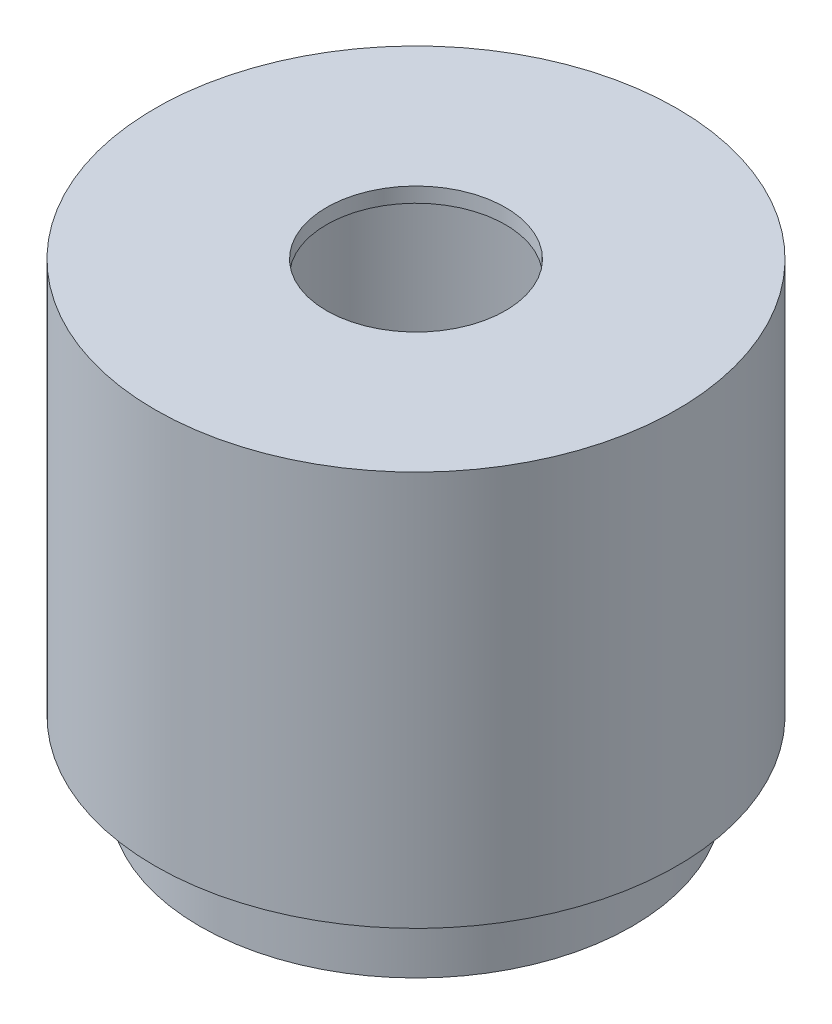
ISO-10303-21;
HEADER;
FILE_DESCRIPTION(('STEP AP214'),'2;1');
FILE_NAME('part.step','',(''),(''),'','','');
FILE_SCHEMA(('AUTOMOTIVE_DESIGN { 1 0 10303 214 1 1 1 1 }'));
ENDSEC;
DATA;
#1=APPLICATION_CONTEXT('core data for automotive mechanical design processes');
#2=APPLICATION_PROTOCOL_DEFINITION('international standard','automotive_design',2000,#1);
#3=PRODUCT_CONTEXT('',#1,'mechanical');
#4=PRODUCT('Part','Part','',(#3));
#5=PRODUCT_RELATED_PRODUCT_CATEGORY('part','',(#4));
#6=PRODUCT_DEFINITION_FORMATION('','',#4);
#7=PRODUCT_DEFINITION_CONTEXT('part definition',#1,'design');
#8=PRODUCT_DEFINITION('design','',#6,#7);
#9=PRODUCT_DEFINITION_SHAPE('','',#8);
#10=(LENGTH_UNIT() NAMED_UNIT(*) SI_UNIT(.MILLI.,.METRE.));
#11=(NAMED_UNIT(*) PLANE_ANGLE_UNIT() SI_UNIT($,.RADIAN.));
#12=(NAMED_UNIT(*) SI_UNIT($,.STERADIAN.) SOLID_ANGLE_UNIT());
#13=UNCERTAINTY_MEASURE_WITH_UNIT(LENGTH_MEASURE(1.E-05),#10,'distance_accuracy_value','');
#14=(GEOMETRIC_REPRESENTATION_CONTEXT(3) GLOBAL_UNCERTAINTY_ASSIGNED_CONTEXT((#13)) GLOBAL_UNIT_ASSIGNED_CONTEXT((#10,
#11,#12)) REPRESENTATION_CONTEXT('',''));
#15=CARTESIAN_POINT('',(0.,0.,0.));
#16=DIRECTION('',(0.,0.,1.));
#17=DIRECTION('',(1.,0.,0.));
#18=AXIS2_PLACEMENT_3D('',#15,#16,#17);
#19=CARTESIAN_POINT('',(0.,0.,0.));
#20=DIRECTION('',(0.,1.,0.));
#21=DIRECTION('',(0.,0.,1.));
#22=AXIS2_PLACEMENT_3D('',#19,#20,#21);
#23=PLANE('',#22);
#24=CARTESIAN_POINT('',(0.,0.,0.));
#25=DIRECTION('',(0.,1.,0.));
#26=DIRECTION('',(0.,0.,1.));
#27=AXIS2_PLACEMENT_3D('',#24,#25,#26);
#28=CIRCLE('',#27,17.5);
#29=CARTESIAN_POINT('',(0.,0.,17.5));
#30=VERTEX_POINT('',#29);
#31=EDGE_CURVE('E45',#30,#30,#28,.T.);
#32=ORIENTED_EDGE('',*,*,#31,.F.);
#33=EDGE_LOOP('',(#32));
#34=FACE_BOUND('',#33,.T.);
#35=CARTESIAN_POINT('',(0.,0.,0.));
#36=DIRECTION('',(0.,1.,0.));
#37=DIRECTION('',(0.,0.,1.));
#38=AXIS2_PLACEMENT_3D('',#35,#36,#37);
#39=CIRCLE('',#38,14.5);
#40=CARTESIAN_POINT('',(0.,0.,14.5));
#41=VERTEX_POINT('',#40);
#42=EDGE_CURVE('E10',#41,#41,#39,.F.);
#43=ORIENTED_EDGE('',*,*,#42,.F.);
#44=EDGE_LOOP('',(#43));
#45=FACE_BOUND('',#44,.T.);
#46=ADVANCED_FACE('F34',(#34,#45),#23,.F.);
#47=CARTESIAN_POINT('',(0.,26.5,0.));
#48=DIRECTION('',(0.,-1.,0.));
#49=DIRECTION('',(0.,0.,-1.));
#50=AXIS2_PLACEMENT_3D('',#47,#48,#49);
#51=CYLINDRICAL_SURFACE('',#50,12.);
#52=CARTESIAN_POINT('',(0.,25.5,0.));
#53=DIRECTION('',(0.,1.,0.));
#54=DIRECTION('',(0.,0.,1.));
#55=AXIS2_PLACEMENT_3D('',#52,#53,#54);
#56=CIRCLE('',#55,12.);
#57=CARTESIAN_POINT('',(0.,25.5,12.));
#58=VERTEX_POINT('',#57);
#59=EDGE_CURVE('E50',#58,#58,#56,.T.);
#60=ORIENTED_EDGE('',*,*,#59,.T.);
#61=EDGE_LOOP('',(#60));
#62=FACE_BOUND('',#61,.T.);
#63=CARTESIAN_POINT('',(0.,-5.,0.));
#64=DIRECTION('',(0.,-1.,0.));
#65=DIRECTION('',(0.,0.,-1.));
#66=AXIS2_PLACEMENT_3D('',#63,#64,#65);
#67=CIRCLE('',#66,12.);
#68=CARTESIAN_POINT('',(0.,-5.,-12.));
#69=VERTEX_POINT('',#68);
#70=EDGE_CURVE('E63',#69,#69,#67,.T.);
#71=ORIENTED_EDGE('',*,*,#70,.T.);
#72=EDGE_LOOP('',(#71));
#73=FACE_BOUND('',#72,.T.);
#74=ADVANCED_FACE('F67',(#62,#73),#51,.F.);
#75=CARTESIAN_POINT('',(0.,26.5,0.));
#76=DIRECTION('',(0.,1.,0.));
#77=DIRECTION('',(0.,0.,1.));
#78=AXIS2_PLACEMENT_3D('',#75,#76,#77);
#79=PLANE('',#78);
#80=CARTESIAN_POINT('',(0.,26.5,0.));
#81=DIRECTION('',(0.,1.,0.));
#82=DIRECTION('',(0.,0.,1.));
#83=AXIS2_PLACEMENT_3D('',#80,#81,#82);
#84=CIRCLE('',#83,17.5);
#85=CARTESIAN_POINT('',(0.,26.5,17.5));
#86=VERTEX_POINT('',#85);
#87=EDGE_CURVE('E41',#86,#86,#84,.T.);
#88=ORIENTED_EDGE('',*,*,#87,.T.);
#89=EDGE_LOOP('',(#88));
#90=FACE_BOUND('',#89,.T.);
#91=CARTESIAN_POINT('',(0.,26.5,0.));
#92=DIRECTION('',(0.,1.,0.));
#93=DIRECTION('',(0.,0.,1.));
#94=AXIS2_PLACEMENT_3D('',#91,#92,#93);
#95=CIRCLE('',#94,6.);
#96=CARTESIAN_POINT('',(0.,26.5,6.));
#97=VERTEX_POINT('',#96);
#98=EDGE_CURVE('E55',#97,#97,#95,.T.);
#99=ORIENTED_EDGE('',*,*,#98,.F.);
#100=EDGE_LOOP('',(#99));
#101=FACE_BOUND('',#100,.T.);
#102=ADVANCED_FACE('F89',(#90,#101),#79,.T.);
#103=CARTESIAN_POINT('',(0.,26.5,0.));
#104=DIRECTION('',(0.,-1.,0.));
#105=DIRECTION('',(0.,0.,-1.));
#106=AXIS2_PLACEMENT_3D('',#103,#104,#105);
#107=CYLINDRICAL_SURFACE('',#106,17.5);
#108=ORIENTED_EDGE('',*,*,#87,.F.);
#109=EDGE_LOOP('',(#108));
#110=FACE_BOUND('',#109,.T.);
#111=ORIENTED_EDGE('',*,*,#31,.T.);
#112=EDGE_LOOP('',(#111));
#113=FACE_BOUND('',#112,.T.);
#114=ADVANCED_FACE('F36',(#110,#113),#107,.T.);
#115=CARTESIAN_POINT('',(0.,25.5,0.));
#116=DIRECTION('',(0.,1.,0.));
#117=DIRECTION('',(0.,0.,1.));
#118=AXIS2_PLACEMENT_3D('',#115,#116,#117);
#119=PLANE('',#118);
#120=CARTESIAN_POINT('',(0.,25.5,0.));
#121=DIRECTION('',(0.,1.,0.));
#122=DIRECTION('',(0.,0.,1.));
#123=AXIS2_PLACEMENT_3D('',#120,#121,#122);
#124=CIRCLE('',#123,6.);
#125=CARTESIAN_POINT('',(0.,25.5,6.));
#126=VERTEX_POINT('',#125);
#127=EDGE_CURVE('E54',#126,#126,#124,.T.);
#128=ORIENTED_EDGE('',*,*,#127,.T.);
#129=EDGE_LOOP('',(#128));
#130=FACE_BOUND('',#129,.T.);
#131=ORIENTED_EDGE('',*,*,#59,.F.);
#132=EDGE_LOOP('',(#131));
#133=FACE_BOUND('',#132,.T.);
#134=ADVANCED_FACE('F81',(#130,#133),#119,.F.);
#135=CARTESIAN_POINT('',(0.,25.5,0.));
#136=DIRECTION('',(0.,1.,0.));
#137=DIRECTION('',(0.,0.,1.));
#138=AXIS2_PLACEMENT_3D('',#135,#136,#137);
#139=CYLINDRICAL_SURFACE('',#138,6.);
#140=ORIENTED_EDGE('',*,*,#127,.F.);
#141=EDGE_LOOP('',(#140));
#142=FACE_BOUND('',#141,.T.);
#143=ORIENTED_EDGE('',*,*,#98,.T.);
#144=EDGE_LOOP('',(#143));
#145=FACE_BOUND('',#144,.T.);
#146=ADVANCED_FACE('F72',(#142,#145),#139,.F.);
#147=CARTESIAN_POINT('',(0.,-5.,0.));
#148=DIRECTION('',(0.,-1.,0.));
#149=DIRECTION('',(0.,0.,-1.));
#150=AXIS2_PLACEMENT_3D('',#147,#148,#149);
#151=PLANE('',#150);
#152=CARTESIAN_POINT('',(0.,-5.,0.));
#153=DIRECTION('',(0.,-1.,0.));
#154=DIRECTION('',(0.,0.,-1.));
#155=AXIS2_PLACEMENT_3D('',#152,#153,#154);
#156=CIRCLE('',#155,14.5);
#157=CARTESIAN_POINT('',(0.,-5.,-14.5));
#158=VERTEX_POINT('',#157);
#159=EDGE_CURVE('E58',#158,#158,#156,.T.);
#160=ORIENTED_EDGE('',*,*,#159,.T.);
#161=EDGE_LOOP('',(#160));
#162=FACE_BOUND('',#161,.T.);
#163=ORIENTED_EDGE('',*,*,#70,.F.);
#164=EDGE_LOOP('',(#163));
#165=FACE_BOUND('',#164,.T.);
#166=ADVANCED_FACE('F69',(#162,#165),#151,.T.);
#167=CARTESIAN_POINT('',(0.,-5.,0.));
#168=DIRECTION('',(0.,1.,0.));
#169=DIRECTION('',(0.,0.,1.));
#170=AXIS2_PLACEMENT_3D('',#167,#168,#169);
#171=CYLINDRICAL_SURFACE('',#170,14.5);
#172=ORIENTED_EDGE('',*,*,#159,.F.);
#173=EDGE_LOOP('',(#172));
#174=FACE_BOUND('',#173,.T.);
#175=ORIENTED_EDGE('',*,*,#42,.T.);
#176=EDGE_LOOP('',(#175));
#177=FACE_BOUND('',#176,.T.);
#178=ADVANCED_FACE('F71',(#174,#177),#171,.T.);
#179=CLOSED_SHELL('',(#46,#74,#102,#114,#134,#146,#166,#178));
#180=MANIFOLD_SOLID_BREP('B2',#179);
#181=ADVANCED_BREP_SHAPE_REPRESENTATION('',(#18,#180),#14);
#182=SHAPE_DEFINITION_REPRESENTATION(#9,#181);
ENDSEC;
END-ISO-10303-21;
